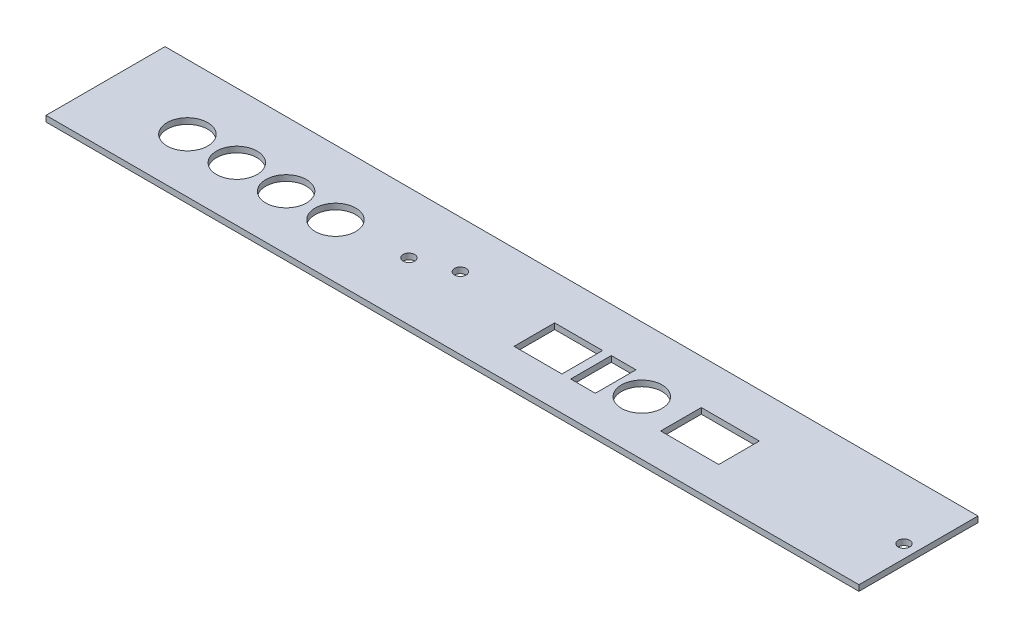
ISO-10303-21;
HEADER;
FILE_DESCRIPTION(('STEP AP214'),'2;1');
FILE_NAME('part.step','',(''),(''),'','','');
FILE_SCHEMA(('AUTOMOTIVE_DESIGN { 1 0 10303 214 1 1 1 1 }'));
ENDSEC;
DATA;
#1=APPLICATION_CONTEXT('core data for automotive mechanical design processes');
#2=APPLICATION_PROTOCOL_DEFINITION('international standard','automotive_design',2000,#1);
#3=PRODUCT_CONTEXT('',#1,'mechanical');
#4=PRODUCT('Part','Part','',(#3));
#5=PRODUCT_RELATED_PRODUCT_CATEGORY('part','',(#4));
#6=PRODUCT_DEFINITION_FORMATION('','',#4);
#7=PRODUCT_DEFINITION_CONTEXT('part definition',#1,'design');
#8=PRODUCT_DEFINITION('design','',#6,#7);
#9=PRODUCT_DEFINITION_SHAPE('','',#8);
#10=(LENGTH_UNIT() NAMED_UNIT(*) SI_UNIT(.MILLI.,.METRE.));
#11=(NAMED_UNIT(*) PLANE_ANGLE_UNIT() SI_UNIT($,.RADIAN.));
#12=(NAMED_UNIT(*) SI_UNIT($,.STERADIAN.) SOLID_ANGLE_UNIT());
#13=UNCERTAINTY_MEASURE_WITH_UNIT(LENGTH_MEASURE(1.E-05),#10,'distance_accuracy_value','');
#14=(GEOMETRIC_REPRESENTATION_CONTEXT(3) GLOBAL_UNCERTAINTY_ASSIGNED_CONTEXT((#13)) GLOBAL_UNIT_ASSIGNED_CONTEXT((#10,
#11,#12)) REPRESENTATION_CONTEXT('',''));
#15=CARTESIAN_POINT('',(0.,0.,0.));
#16=DIRECTION('',(0.,0.,1.));
#17=DIRECTION('',(1.,0.,0.));
#18=AXIS2_PLACEMENT_3D('',#15,#16,#17);
#19=CARTESIAN_POINT('',(0.,2.,0.));
#20=DIRECTION('',(0.,-1.,0.));
#21=DIRECTION('',(0.,0.,-1.));
#22=AXIS2_PLACEMENT_3D('',#19,#20,#21);
#23=PLANE('',#22);
#24=CARTESIAN_POINT('',(275.5,2.,-20.));
#25=DIRECTION('',(0.,1.,0.));
#26=DIRECTION('',(0.,0.,1.));
#27=AXIS2_PLACEMENT_3D('',#24,#25,#26);
#28=CIRCLE('',#27,2.);
#29=CARTESIAN_POINT('',(275.5,2.,-18.));
#30=VERTEX_POINT('',#29);
#31=EDGE_CURVE('E184',#30,#30,#28,.T.);
#32=ORIENTED_EDGE('',*,*,#31,.F.);
#33=EDGE_LOOP('',(#32));
#34=FACE_BOUND('',#33,.T.);
#35=CARTESIAN_POINT('',(118.,2.,-24.7));
#36=DIRECTION('',(0.,1.,0.));
#37=DIRECTION('',(0.,0.,1.));
#38=AXIS2_PLACEMENT_3D('',#35,#36,#37);
#39=CIRCLE('',#38,2.);
#40=CARTESIAN_POINT('',(118.,2.,-22.7));
#41=VERTEX_POINT('',#40);
#42=EDGE_CURVE('E196',#41,#41,#39,.T.);
#43=ORIENTED_EDGE('',*,*,#42,.F.);
#44=EDGE_LOOP('',(#43));
#45=FACE_BOUND('',#44,.T.);
#46=DIRECTION('',(0.,0.,1.));
#47=VECTOR('',#46,1.);
#48=CARTESIAN_POINT('',(169.,2.,-11.7));
#49=LINE('',#48,#47);
#50=CARTESIAN_POINT('',(169.,2.,-25.7));
#51=VERTEX_POINT('',#50);
#52=CARTESIAN_POINT('',(169.,2.,-11.7));
#53=VERTEX_POINT('',#52);
#54=EDGE_CURVE('E208',#51,#53,#49,.T.);
#55=ORIENTED_EDGE('',*,*,#54,.F.);
#56=DIRECTION('',(-1.,0.,0.));
#57=VECTOR('',#56,1.);
#58=CARTESIAN_POINT('',(169.,2.,-25.7));
#59=LINE('',#58,#57);
#60=CARTESIAN_POINT('',(177.5,2.,-25.7));
#61=VERTEX_POINT('',#60);
#62=EDGE_CURVE('E216',#61,#51,#59,.T.);
#63=ORIENTED_EDGE('',*,*,#62,.F.);
#64=DIRECTION('',(0.,0.,-1.));
#65=VECTOR('',#64,1.);
#66=CARTESIAN_POINT('',(177.5,2.,-11.7));
#67=LINE('',#66,#65);
#68=CARTESIAN_POINT('',(177.5,2.,-11.7));
#69=VERTEX_POINT('',#68);
#70=EDGE_CURVE('E213',#69,#61,#67,.T.);
#71=ORIENTED_EDGE('',*,*,#70,.F.);
#72=DIRECTION('',(1.,0.,0.));
#73=VECTOR('',#72,1.);
#74=CARTESIAN_POINT('',(169.,2.,-11.7));
#75=LINE('',#74,#73);
#76=EDGE_CURVE('E210',#53,#69,#75,.T.);
#77=ORIENTED_EDGE('',*,*,#76,.F.);
#78=EDGE_LOOP('',(#55,#63,#71,#77));
#79=FACE_BOUND('',#78,.T.);
#80=CARTESIAN_POINT('',(64.,2.,-18.7));
#81=DIRECTION('',(0.,1.,0.));
#82=DIRECTION('',(0.,0.,1.));
#83=AXIS2_PLACEMENT_3D('',#80,#81,#82);
#84=CIRCLE('',#83,7.);
#85=CARTESIAN_POINT('',(64.,2.,-11.7));
#86=VERTEX_POINT('',#85);
#87=EDGE_CURVE('E245',#86,#86,#84,.T.);
#88=ORIENTED_EDGE('',*,*,#87,.F.);
#89=EDGE_LOOP('',(#88));
#90=FACE_BOUND('',#89,.T.);
#91=DIRECTION('',(0.,0.,1.));
#92=VECTOR('',#91,1.);
#93=CARTESIAN_POINT('',(149.5,2.,-11.7));
#94=LINE('',#93,#92);
#95=CARTESIAN_POINT('',(149.5,2.,-25.7));
#96=VERTEX_POINT('',#95);
#97=CARTESIAN_POINT('',(149.5,2.,-11.7));
#98=VERTEX_POINT('',#97);
#99=EDGE_CURVE('E257',#96,#98,#94,.T.);
#100=ORIENTED_EDGE('',*,*,#99,.F.);
#101=DIRECTION('',(-1.,0.,0.));
#102=VECTOR('',#101,1.);
#103=CARTESIAN_POINT('',(149.5,2.,-25.7));
#104=LINE('',#103,#102);
#105=CARTESIAN_POINT('',(166.,2.,-25.7));
#106=VERTEX_POINT('',#105);
#107=EDGE_CURVE('E265',#106,#96,#104,.T.);
#108=ORIENTED_EDGE('',*,*,#107,.F.);
#109=DIRECTION('',(0.,0.,-1.));
#110=VECTOR('',#109,1.);
#111=CARTESIAN_POINT('',(166.,2.,-11.7));
#112=LINE('',#111,#110);
#113=CARTESIAN_POINT('',(166.,2.,-11.7));
#114=VERTEX_POINT('',#113);
#115=EDGE_CURVE('E262',#114,#106,#112,.T.);
#116=ORIENTED_EDGE('',*,*,#115,.F.);
#117=DIRECTION('',(1.,0.,0.));
#118=VECTOR('',#117,1.);
#119=CARTESIAN_POINT('',(149.5,2.,-11.7));
#120=LINE('',#119,#118);
#121=EDGE_CURVE('E259',#98,#114,#120,.T.);
#122=ORIENTED_EDGE('',*,*,#121,.F.);
#123=EDGE_LOOP('',(#100,#108,#116,#122));
#124=FACE_BOUND('',#123,.T.);
#125=DIRECTION('',(0.,0.,1.));
#126=VECTOR('',#125,1.);
#127=CARTESIAN_POINT('',(0.,2.,0.));
#128=LINE('',#127,#126);
#129=CARTESIAN_POINT('',(0.,2.,-41.));
#130=VERTEX_POINT('',#129);
#131=CARTESIAN_POINT('',(0.,2.,0.));
#132=VERTEX_POINT('',#131);
#133=EDGE_CURVE('E294',#130,#132,#128,.T.);
#134=ORIENTED_EDGE('',*,*,#133,.T.);
#135=DIRECTION('',(1.,0.,0.));
#136=VECTOR('',#135,1.);
#137=CARTESIAN_POINT('',(0.,2.,0.));
#138=LINE('',#137,#136);
#139=CARTESIAN_POINT('',(280.,2.,0.));
#140=VERTEX_POINT('',#139);
#141=EDGE_CURVE('E297',#132,#140,#138,.T.);
#142=ORIENTED_EDGE('',*,*,#141,.T.);
#143=DIRECTION('',(0.,0.,-1.));
#144=VECTOR('',#143,1.);
#145=CARTESIAN_POINT('',(280.,2.,0.));
#146=LINE('',#145,#144);
#147=CARTESIAN_POINT('',(280.,2.,-41.));
#148=VERTEX_POINT('',#147);
#149=EDGE_CURVE('E300',#140,#148,#146,.T.);
#150=ORIENTED_EDGE('',*,*,#149,.T.);
#151=DIRECTION('',(-1.,0.,0.));
#152=VECTOR('',#151,1.);
#153=CARTESIAN_POINT('',(0.,2.,-41.));
#154=LINE('',#153,#152);
#155=EDGE_CURVE('E302',#148,#130,#154,.T.);
#156=ORIENTED_EDGE('',*,*,#155,.T.);
#157=EDGE_LOOP('',(#134,#142,#150,#156));
#158=FACE_BOUND('',#157,.T.);
#159=CARTESIAN_POINT('',(30.,2.,-18.7));
#160=DIRECTION('',(0.,1.,0.));
#161=DIRECTION('',(0.,0.,1.));
#162=AXIS2_PLACEMENT_3D('',#159,#160,#161);
#163=CIRCLE('',#162,7.);
#164=CARTESIAN_POINT('',(30.,2.,-11.7));
#165=VERTEX_POINT('',#164);
#166=EDGE_CURVE('E288',#165,#165,#163,.T.);
#167=ORIENTED_EDGE('',*,*,#166,.F.);
#168=EDGE_LOOP('',(#167));
#169=FACE_BOUND('',#168,.T.);
#170=CARTESIAN_POINT('',(47.,2.,-18.7));
#171=DIRECTION('',(0.,1.,0.));
#172=DIRECTION('',(0.,0.,1.));
#173=AXIS2_PLACEMENT_3D('',#170,#171,#172);
#174=CIRCLE('',#173,7.);
#175=CARTESIAN_POINT('',(47.,2.,-11.7));
#176=VERTEX_POINT('',#175);
#177=EDGE_CURVE('E251',#176,#176,#174,.T.);
#178=ORIENTED_EDGE('',*,*,#177,.F.);
#179=EDGE_LOOP('',(#178));
#180=FACE_BOUND('',#179,.T.);
#181=CARTESIAN_POINT('',(81.,2.,-18.7));
#182=DIRECTION('',(0.,1.,0.));
#183=DIRECTION('',(0.,0.,1.));
#184=AXIS2_PLACEMENT_3D('',#181,#182,#183);
#185=CIRCLE('',#184,7.);
#186=CARTESIAN_POINT('',(81.,2.,-11.7));
#187=VERTEX_POINT('',#186);
#188=EDGE_CURVE('E239',#187,#187,#185,.T.);
#189=ORIENTED_EDGE('',*,*,#188,.F.);
#190=EDGE_LOOP('',(#189));
#191=FACE_BOUND('',#190,.T.);
#192=CARTESIAN_POINT('',(186.5,2.,-18.7));
#193=DIRECTION('',(0.,1.,0.));
#194=DIRECTION('',(0.,0.,1.));
#195=AXIS2_PLACEMENT_3D('',#192,#193,#194);
#196=CIRCLE('',#195,7.00000000000001);
#197=CARTESIAN_POINT('',(186.5,2.,-11.7));
#198=VERTEX_POINT('',#197);
#199=EDGE_CURVE('E202',#198,#198,#196,.T.);
#200=ORIENTED_EDGE('',*,*,#199,.F.);
#201=EDGE_LOOP('',(#200));
#202=FACE_BOUND('',#201,.T.);
#203=CARTESIAN_POINT('',(105.,2.,-20.));
#204=DIRECTION('',(0.,1.,0.));
#205=DIRECTION('',(0.,0.,1.));
#206=AXIS2_PLACEMENT_3D('',#203,#204,#205);
#207=CIRCLE('',#206,2.);
#208=CARTESIAN_POINT('',(105.,2.,-18.));
#209=VERTEX_POINT('',#208);
#210=EDGE_CURVE('E190',#209,#209,#207,.T.);
#211=ORIENTED_EDGE('',*,*,#210,.F.);
#212=EDGE_LOOP('',(#211));
#213=FACE_BOUND('',#212,.T.);
#214=DIRECTION('',(0.,0.,1.));
#215=VECTOR('',#214,1.);
#216=CARTESIAN_POINT('',(200.,2.,-11.7));
#217=LINE('',#216,#215);
#218=CARTESIAN_POINT('',(200.,2.,-25.7));
#219=VERTEX_POINT('',#218);
#220=CARTESIAN_POINT('',(200.,2.,-11.7));
#221=VERTEX_POINT('',#220);
#222=EDGE_CURVE('E148',#219,#221,#217,.T.);
#223=ORIENTED_EDGE('',*,*,#222,.F.);
#224=DIRECTION('',(-1.,0.,0.));
#225=VECTOR('',#224,1.);
#226=CARTESIAN_POINT('',(200.,2.,-25.7));
#227=LINE('',#226,#225);
#228=CARTESIAN_POINT('',(220.,2.,-25.7));
#229=VERTEX_POINT('',#228);
#230=EDGE_CURVE('E170',#229,#219,#227,.T.);
#231=ORIENTED_EDGE('',*,*,#230,.F.);
#232=DIRECTION('',(0.,0.,-1.));
#233=VECTOR('',#232,1.);
#234=CARTESIAN_POINT('',(220.,2.,-11.7));
#235=LINE('',#234,#233);
#236=CARTESIAN_POINT('',(220.,2.,-11.7));
#237=VERTEX_POINT('',#236);
#238=EDGE_CURVE('E168',#237,#229,#235,.T.);
#239=ORIENTED_EDGE('',*,*,#238,.F.);
#240=DIRECTION('',(1.,0.,0.));
#241=VECTOR('',#240,1.);
#242=CARTESIAN_POINT('',(200.,2.,-11.7));
#243=LINE('',#242,#241);
#244=EDGE_CURVE('E156',#221,#237,#243,.T.);
#245=ORIENTED_EDGE('',*,*,#244,.F.);
#246=EDGE_LOOP('',(#223,#231,#239,#245));
#247=FACE_BOUND('',#246,.T.);
#248=ADVANCED_FACE('F35',(#34,#45,#79,#90,#124,#158,#169,#180,#191,#202,#213,#247),#23,.F.);
#249=CARTESIAN_POINT('',(0.,0.,0.));
#250=DIRECTION('',(0.,-1.,0.));
#251=DIRECTION('',(0.,0.,-1.));
#252=AXIS2_PLACEMENT_3D('',#249,#250,#251);
#253=PLANE('',#252);
#254=CARTESIAN_POINT('',(275.5,0.,-20.));
#255=DIRECTION('',(0.,1.,0.));
#256=DIRECTION('',(0.,0.,1.));
#257=AXIS2_PLACEMENT_3D('',#254,#255,#256);
#258=CIRCLE('',#257,2.);
#259=CARTESIAN_POINT('',(275.5,0.,-18.));
#260=VERTEX_POINT('',#259);
#261=EDGE_CURVE('E164',#260,#260,#258,.T.);
#262=ORIENTED_EDGE('',*,*,#261,.T.);
#263=EDGE_LOOP('',(#262));
#264=FACE_BOUND('',#263,.T.);
#265=CARTESIAN_POINT('',(118.,0.,-24.7));
#266=DIRECTION('',(0.,1.,0.));
#267=DIRECTION('',(0.,0.,1.));
#268=AXIS2_PLACEMENT_3D('',#265,#266,#267);
#269=CIRCLE('',#268,2.);
#270=CARTESIAN_POINT('',(118.,0.,-22.7));
#271=VERTEX_POINT('',#270);
#272=EDGE_CURVE('E193',#271,#271,#269,.T.);
#273=ORIENTED_EDGE('',*,*,#272,.T.);
#274=EDGE_LOOP('',(#273));
#275=FACE_BOUND('',#274,.T.);
#276=DIRECTION('',(-1.,0.,0.));
#277=VECTOR('',#276,1.);
#278=CARTESIAN_POINT('',(169.,0.,-25.7));
#279=LINE('',#278,#277);
#280=CARTESIAN_POINT('',(177.5,0.,-25.7));
#281=VERTEX_POINT('',#280);
#282=CARTESIAN_POINT('',(169.,0.,-25.7));
#283=VERTEX_POINT('',#282);
#284=EDGE_CURVE('E211',#281,#283,#279,.T.);
#285=ORIENTED_EDGE('',*,*,#284,.T.);
#286=DIRECTION('',(0.,0.,1.));
#287=VECTOR('',#286,1.);
#288=CARTESIAN_POINT('',(169.,0.,-11.7));
#289=LINE('',#288,#287);
#290=CARTESIAN_POINT('',(169.,0.,-11.7));
#291=VERTEX_POINT('',#290);
#292=EDGE_CURVE('E205',#283,#291,#289,.T.);
#293=ORIENTED_EDGE('',*,*,#292,.T.);
#294=DIRECTION('',(1.,0.,0.));
#295=VECTOR('',#294,1.);
#296=CARTESIAN_POINT('',(169.,0.,-11.7));
#297=LINE('',#296,#295);
#298=CARTESIAN_POINT('',(177.5,0.,-11.7));
#299=VERTEX_POINT('',#298);
#300=EDGE_CURVE('E221',#291,#299,#297,.T.);
#301=ORIENTED_EDGE('',*,*,#300,.T.);
#302=DIRECTION('',(0.,0.,-1.));
#303=VECTOR('',#302,1.);
#304=CARTESIAN_POINT('',(177.5,0.,-11.7));
#305=LINE('',#304,#303);
#306=EDGE_CURVE('E224',#299,#281,#305,.T.);
#307=ORIENTED_EDGE('',*,*,#306,.T.);
#308=EDGE_LOOP('',(#285,#293,#301,#307));
#309=FACE_BOUND('',#308,.T.);
#310=CARTESIAN_POINT('',(64.,0.,-18.7));
#311=DIRECTION('',(0.,1.,0.));
#312=DIRECTION('',(0.,0.,1.));
#313=AXIS2_PLACEMENT_3D('',#310,#311,#312);
#314=CIRCLE('',#313,7.);
#315=CARTESIAN_POINT('',(64.,0.,-11.7));
#316=VERTEX_POINT('',#315);
#317=EDGE_CURVE('E242',#316,#316,#314,.T.);
#318=ORIENTED_EDGE('',*,*,#317,.T.);
#319=EDGE_LOOP('',(#318));
#320=FACE_BOUND('',#319,.T.);
#321=DIRECTION('',(-1.,0.,0.));
#322=VECTOR('',#321,1.);
#323=CARTESIAN_POINT('',(149.5,0.,-25.7));
#324=LINE('',#323,#322);
#325=CARTESIAN_POINT('',(166.,0.,-25.7));
#326=VERTEX_POINT('',#325);
#327=CARTESIAN_POINT('',(149.5,0.,-25.7));
#328=VERTEX_POINT('',#327);
#329=EDGE_CURVE('E260',#326,#328,#324,.T.);
#330=ORIENTED_EDGE('',*,*,#329,.T.);
#331=DIRECTION('',(0.,0.,1.));
#332=VECTOR('',#331,1.);
#333=CARTESIAN_POINT('',(149.5,0.,-11.7));
#334=LINE('',#333,#332);
#335=CARTESIAN_POINT('',(149.5,0.,-11.7));
#336=VERTEX_POINT('',#335);
#337=EDGE_CURVE('E254',#328,#336,#334,.T.);
#338=ORIENTED_EDGE('',*,*,#337,.T.);
#339=DIRECTION('',(1.,0.,0.));
#340=VECTOR('',#339,1.);
#341=CARTESIAN_POINT('',(149.5,0.,-11.7));
#342=LINE('',#341,#340);
#343=CARTESIAN_POINT('',(166.,0.,-11.7));
#344=VERTEX_POINT('',#343);
#345=EDGE_CURVE('E270',#336,#344,#342,.T.);
#346=ORIENTED_EDGE('',*,*,#345,.T.);
#347=DIRECTION('',(0.,0.,-1.));
#348=VECTOR('',#347,1.);
#349=CARTESIAN_POINT('',(166.,0.,-11.7));
#350=LINE('',#349,#348);
#351=EDGE_CURVE('E273',#344,#326,#350,.T.);
#352=ORIENTED_EDGE('',*,*,#351,.T.);
#353=EDGE_LOOP('',(#330,#338,#346,#352));
#354=FACE_BOUND('',#353,.T.);
#355=DIRECTION('',(0.,0.,1.));
#356=VECTOR('',#355,1.);
#357=CARTESIAN_POINT('',(0.,0.,0.));
#358=LINE('',#357,#356);
#359=CARTESIAN_POINT('',(0.,0.,-41.));
#360=VERTEX_POINT('',#359);
#361=CARTESIAN_POINT('',(0.,0.,0.));
#362=VERTEX_POINT('',#361);
#363=EDGE_CURVE('E291',#360,#362,#358,.T.);
#364=ORIENTED_EDGE('',*,*,#363,.F.);
#365=DIRECTION('',(-1.,0.,0.));
#366=VECTOR('',#365,1.);
#367=CARTESIAN_POINT('',(0.,0.,-41.));
#368=LINE('',#367,#366);
#369=CARTESIAN_POINT('',(280.,0.,-41.));
#370=VERTEX_POINT('',#369);
#371=EDGE_CURVE('E298',#370,#360,#368,.T.);
#372=ORIENTED_EDGE('',*,*,#371,.F.);
#373=DIRECTION('',(0.,0.,-1.));
#374=VECTOR('',#373,1.);
#375=CARTESIAN_POINT('',(280.,0.,0.));
#376=LINE('',#375,#374);
#377=CARTESIAN_POINT('',(280.,0.,0.));
#378=VERTEX_POINT('',#377);
#379=EDGE_CURVE('E309',#378,#370,#376,.T.);
#380=ORIENTED_EDGE('',*,*,#379,.F.);
#381=DIRECTION('',(1.,0.,0.));
#382=VECTOR('',#381,1.);
#383=CARTESIAN_POINT('',(0.,0.,0.));
#384=LINE('',#383,#382);
#385=EDGE_CURVE('E307',#362,#378,#384,.T.);
#386=ORIENTED_EDGE('',*,*,#385,.F.);
#387=EDGE_LOOP('',(#364,#372,#380,#386));
#388=FACE_BOUND('',#387,.T.);
#389=CARTESIAN_POINT('',(30.,0.,-18.7));
#390=DIRECTION('',(0.,1.,0.));
#391=DIRECTION('',(0.,0.,1.));
#392=AXIS2_PLACEMENT_3D('',#389,#390,#391);
#393=CIRCLE('',#392,7.);
#394=CARTESIAN_POINT('',(30.,0.,-11.7));
#395=VERTEX_POINT('',#394);
#396=EDGE_CURVE('E287',#395,#395,#393,.T.);
#397=ORIENTED_EDGE('',*,*,#396,.T.);
#398=EDGE_LOOP('',(#397));
#399=FACE_BOUND('',#398,.T.);
#400=CARTESIAN_POINT('',(47.,0.,-18.7));
#401=DIRECTION('',(0.,1.,0.));
#402=DIRECTION('',(0.,0.,1.));
#403=AXIS2_PLACEMENT_3D('',#400,#401,#402);
#404=CIRCLE('',#403,7.);
#405=CARTESIAN_POINT('',(47.,0.,-11.7));
#406=VERTEX_POINT('',#405);
#407=EDGE_CURVE('E248',#406,#406,#404,.T.);
#408=ORIENTED_EDGE('',*,*,#407,.T.);
#409=EDGE_LOOP('',(#408));
#410=FACE_BOUND('',#409,.T.);
#411=CARTESIAN_POINT('',(81.,0.,-18.7));
#412=DIRECTION('',(0.,1.,0.));
#413=DIRECTION('',(0.,0.,1.));
#414=AXIS2_PLACEMENT_3D('',#411,#412,#413);
#415=CIRCLE('',#414,7.);
#416=CARTESIAN_POINT('',(81.,0.,-11.7));
#417=VERTEX_POINT('',#416);
#418=EDGE_CURVE('E238',#417,#417,#415,.T.);
#419=ORIENTED_EDGE('',*,*,#418,.T.);
#420=EDGE_LOOP('',(#419));
#421=FACE_BOUND('',#420,.T.);
#422=CARTESIAN_POINT('',(186.5,0.,-18.7));
#423=DIRECTION('',(0.,1.,0.));
#424=DIRECTION('',(0.,0.,1.));
#425=AXIS2_PLACEMENT_3D('',#422,#423,#424);
#426=CIRCLE('',#425,7.00000000000001);
#427=CARTESIAN_POINT('',(186.5,0.,-11.7));
#428=VERTEX_POINT('',#427);
#429=EDGE_CURVE('E199',#428,#428,#426,.T.);
#430=ORIENTED_EDGE('',*,*,#429,.T.);
#431=EDGE_LOOP('',(#430));
#432=FACE_BOUND('',#431,.T.);
#433=CARTESIAN_POINT('',(105.,0.,-20.));
#434=DIRECTION('',(0.,1.,0.));
#435=DIRECTION('',(0.,0.,1.));
#436=AXIS2_PLACEMENT_3D('',#433,#434,#435);
#437=CIRCLE('',#436,2.);
#438=CARTESIAN_POINT('',(105.,0.,-18.));
#439=VERTEX_POINT('',#438);
#440=EDGE_CURVE('E187',#439,#439,#437,.T.);
#441=ORIENTED_EDGE('',*,*,#440,.T.);
#442=EDGE_LOOP('',(#441));
#443=FACE_BOUND('',#442,.T.);
#444=DIRECTION('',(-1.,0.,0.));
#445=VECTOR('',#444,1.);
#446=CARTESIAN_POINT('',(200.,0.,-25.7));
#447=LINE('',#446,#445);
#448=CARTESIAN_POINT('',(220.,0.,-25.7));
#449=VERTEX_POINT('',#448);
#450=CARTESIAN_POINT('',(200.,0.,-25.7));
#451=VERTEX_POINT('',#450);
#452=EDGE_CURVE('E157',#449,#451,#447,.T.);
#453=ORIENTED_EDGE('',*,*,#452,.T.);
#454=DIRECTION('',(0.,0.,1.));
#455=VECTOR('',#454,1.);
#456=CARTESIAN_POINT('',(200.,0.,-11.7));
#457=LINE('',#456,#455);
#458=CARTESIAN_POINT('',(200.,0.,-11.7));
#459=VERTEX_POINT('',#458);
#460=EDGE_CURVE('E58',#451,#459,#457,.T.);
#461=ORIENTED_EDGE('',*,*,#460,.T.);
#462=DIRECTION('',(1.,0.,0.));
#463=VECTOR('',#462,1.);
#464=CARTESIAN_POINT('',(200.,0.,-11.7));
#465=LINE('',#464,#463);
#466=CARTESIAN_POINT('',(220.,0.,-11.7));
#467=VERTEX_POINT('',#466);
#468=EDGE_CURVE('E163',#459,#467,#465,.T.);
#469=ORIENTED_EDGE('',*,*,#468,.T.);
#470=DIRECTION('',(0.,0.,-1.));
#471=VECTOR('',#470,1.);
#472=CARTESIAN_POINT('',(220.,0.,-11.7));
#473=LINE('',#472,#471);
#474=EDGE_CURVE('E176',#467,#449,#473,.T.);
#475=ORIENTED_EDGE('',*,*,#474,.T.);
#476=EDGE_LOOP('',(#453,#461,#469,#475));
#477=FACE_BOUND('',#476,.T.);
#478=ADVANCED_FACE('F327',(#264,#275,#309,#320,#354,#388,#399,#410,#421,#432,#443,#477),#253,.T.);
#479=CARTESIAN_POINT('',(0.,2.,0.));
#480=DIRECTION('',(1.,0.,0.));
#481=DIRECTION('',(0.,0.,-1.));
#482=AXIS2_PLACEMENT_3D('',#479,#480,#481);
#483=PLANE('',#482);
#484=ORIENTED_EDGE('',*,*,#363,.T.);
#485=DIRECTION('',(0.,-1.,0.));
#486=VECTOR('',#485,1.);
#487=CARTESIAN_POINT('',(0.,2.,0.));
#488=LINE('',#487,#486);
#489=EDGE_CURVE('E11',#132,#362,#488,.T.);
#490=ORIENTED_EDGE('',*,*,#489,.F.);
#491=ORIENTED_EDGE('',*,*,#133,.F.);
#492=DIRECTION('',(0.,-1.,0.));
#493=VECTOR('',#492,1.);
#494=CARTESIAN_POINT('',(0.,2.,-41.));
#495=LINE('',#494,#493);
#496=EDGE_CURVE('E304',#130,#360,#495,.T.);
#497=ORIENTED_EDGE('',*,*,#496,.T.);
#498=EDGE_LOOP('',(#484,#490,#491,#497));
#499=FACE_BOUND('',#498,.T.);
#500=ADVANCED_FACE('F37',(#499),#483,.F.);
#501=CARTESIAN_POINT('',(0.,2.,0.));
#502=DIRECTION('',(0.,0.,-1.));
#503=DIRECTION('',(-1.,0.,0.));
#504=AXIS2_PLACEMENT_3D('',#501,#502,#503);
#505=PLANE('',#504);
#506=ORIENTED_EDGE('',*,*,#385,.T.);
#507=DIRECTION('',(0.,-1.,0.));
#508=VECTOR('',#507,1.);
#509=CARTESIAN_POINT('',(280.,2.,0.));
#510=LINE('',#509,#508);
#511=EDGE_CURVE('E43',#140,#378,#510,.T.);
#512=ORIENTED_EDGE('',*,*,#511,.F.);
#513=ORIENTED_EDGE('',*,*,#141,.F.);
#514=ORIENTED_EDGE('',*,*,#489,.T.);
#515=EDGE_LOOP('',(#506,#512,#513,#514));
#516=FACE_BOUND('',#515,.T.);
#517=ADVANCED_FACE('F338',(#516),#505,.F.);
#518=CARTESIAN_POINT('',(280.,2.,0.));
#519=DIRECTION('',(-1.,0.,0.));
#520=DIRECTION('',(0.,0.,1.));
#521=AXIS2_PLACEMENT_3D('',#518,#519,#520);
#522=PLANE('',#521);
#523=ORIENTED_EDGE('',*,*,#379,.T.);
#524=DIRECTION('',(0.,-1.,0.));
#525=VECTOR('',#524,1.);
#526=CARTESIAN_POINT('',(280.,2.,-41.));
#527=LINE('',#526,#525);
#528=EDGE_CURVE('E314',#148,#370,#527,.T.);
#529=ORIENTED_EDGE('',*,*,#528,.F.);
#530=ORIENTED_EDGE('',*,*,#149,.F.);
#531=ORIENTED_EDGE('',*,*,#511,.T.);
#532=EDGE_LOOP('',(#523,#529,#530,#531));
#533=FACE_BOUND('',#532,.T.);
#534=ADVANCED_FACE('F321',(#533),#522,.F.);
#535=CARTESIAN_POINT('',(0.,2.,-41.));
#536=DIRECTION('',(0.,0.,1.));
#537=DIRECTION('',(1.,0.,0.));
#538=AXIS2_PLACEMENT_3D('',#535,#536,#537);
#539=PLANE('',#538);
#540=ORIENTED_EDGE('',*,*,#371,.T.);
#541=ORIENTED_EDGE('',*,*,#496,.F.);
#542=ORIENTED_EDGE('',*,*,#155,.F.);
#543=ORIENTED_EDGE('',*,*,#528,.T.);
#544=EDGE_LOOP('',(#540,#541,#542,#543));
#545=FACE_BOUND('',#544,.T.);
#546=ADVANCED_FACE('F331',(#545),#539,.F.);
#547=CARTESIAN_POINT('',(30.,2.,-18.7));
#548=DIRECTION('',(0.,-1.,0.));
#549=DIRECTION('',(0.,0.,-1.));
#550=AXIS2_PLACEMENT_3D('',#547,#548,#549);
#551=CYLINDRICAL_SURFACE('',#550,7.);
#552=ORIENTED_EDGE('',*,*,#166,.T.);
#553=EDGE_LOOP('',(#552));
#554=FACE_BOUND('',#553,.T.);
#555=ORIENTED_EDGE('',*,*,#396,.F.);
#556=EDGE_LOOP('',(#555));
#557=FACE_BOUND('',#556,.T.);
#558=ADVANCED_FACE('F356',(#554,#557),#551,.F.);
#559=CARTESIAN_POINT('',(149.5,2.,-11.7));
#560=DIRECTION('',(1.,0.,0.));
#561=DIRECTION('',(0.,0.,-1.));
#562=AXIS2_PLACEMENT_3D('',#559,#560,#561);
#563=PLANE('',#562);
#564=ORIENTED_EDGE('',*,*,#337,.F.);
#565=DIRECTION('',(0.,-1.,0.));
#566=VECTOR('',#565,1.);
#567=CARTESIAN_POINT('',(149.5,2.,-25.7));
#568=LINE('',#567,#566);
#569=EDGE_CURVE('E267',#96,#328,#568,.T.);
#570=ORIENTED_EDGE('',*,*,#569,.F.);
#571=ORIENTED_EDGE('',*,*,#99,.T.);
#572=DIRECTION('',(0.,-1.,0.));
#573=VECTOR('',#572,1.);
#574=CARTESIAN_POINT('',(149.5,2.,-11.7));
#575=LINE('',#574,#573);
#576=EDGE_CURVE('E284',#98,#336,#575,.T.);
#577=ORIENTED_EDGE('',*,*,#576,.T.);
#578=EDGE_LOOP('',(#564,#570,#571,#577));
#579=FACE_BOUND('',#578,.T.);
#580=ADVANCED_FACE('F363',(#579),#563,.T.);
#581=CARTESIAN_POINT('',(149.5,2.,-11.7));
#582=DIRECTION('',(0.,0.,-1.));
#583=DIRECTION('',(-1.,0.,0.));
#584=AXIS2_PLACEMENT_3D('',#581,#582,#583);
#585=PLANE('',#584);
#586=ORIENTED_EDGE('',*,*,#345,.F.);
#587=ORIENTED_EDGE('',*,*,#576,.F.);
#588=ORIENTED_EDGE('',*,*,#121,.T.);
#589=DIRECTION('',(0.,-1.,0.));
#590=VECTOR('',#589,1.);
#591=CARTESIAN_POINT('',(166.,2.,-11.7));
#592=LINE('',#591,#590);
#593=EDGE_CURVE('E282',#114,#344,#592,.T.);
#594=ORIENTED_EDGE('',*,*,#593,.T.);
#595=EDGE_LOOP('',(#586,#587,#588,#594));
#596=FACE_BOUND('',#595,.T.);
#597=ADVANCED_FACE('F368',(#596),#585,.T.);
#598=CARTESIAN_POINT('',(166.,2.,-11.7));
#599=DIRECTION('',(-1.,0.,0.));
#600=DIRECTION('',(0.,0.,1.));
#601=AXIS2_PLACEMENT_3D('',#598,#599,#600);
#602=PLANE('',#601);
#603=ORIENTED_EDGE('',*,*,#351,.F.);
#604=ORIENTED_EDGE('',*,*,#593,.F.);
#605=ORIENTED_EDGE('',*,*,#115,.T.);
#606=DIRECTION('',(0.,-1.,0.));
#607=VECTOR('',#606,1.);
#608=CARTESIAN_POINT('',(166.,2.,-25.7));
#609=LINE('',#608,#607);
#610=EDGE_CURVE('E280',#106,#326,#609,.T.);
#611=ORIENTED_EDGE('',*,*,#610,.T.);
#612=EDGE_LOOP('',(#603,#604,#605,#611));
#613=FACE_BOUND('',#612,.T.);
#614=ADVANCED_FACE('F444',(#613),#602,.T.);
#615=CARTESIAN_POINT('',(149.5,2.,-25.7));
#616=DIRECTION('',(0.,0.,1.));
#617=DIRECTION('',(1.,0.,0.));
#618=AXIS2_PLACEMENT_3D('',#615,#616,#617);
#619=PLANE('',#618);
#620=ORIENTED_EDGE('',*,*,#329,.F.);
#621=ORIENTED_EDGE('',*,*,#610,.F.);
#622=ORIENTED_EDGE('',*,*,#107,.T.);
#623=ORIENTED_EDGE('',*,*,#569,.T.);
#624=EDGE_LOOP('',(#620,#621,#622,#623));
#625=FACE_BOUND('',#624,.T.);
#626=ADVANCED_FACE('F440',(#625),#619,.T.);
#627=CARTESIAN_POINT('',(47.,2.,-18.7));
#628=DIRECTION('',(0.,-1.,0.));
#629=DIRECTION('',(0.,0.,-1.));
#630=AXIS2_PLACEMENT_3D('',#627,#628,#629);
#631=CYLINDRICAL_SURFACE('',#630,7.);
#632=ORIENTED_EDGE('',*,*,#177,.T.);
#633=EDGE_LOOP('',(#632));
#634=FACE_BOUND('',#633,.T.);
#635=ORIENTED_EDGE('',*,*,#407,.F.);
#636=EDGE_LOOP('',(#635));
#637=FACE_BOUND('',#636,.T.);
#638=ADVANCED_FACE('F436',(#634,#637),#631,.F.);
#639=CARTESIAN_POINT('',(64.,2.,-18.7));
#640=DIRECTION('',(0.,-1.,0.));
#641=DIRECTION('',(0.,0.,-1.));
#642=AXIS2_PLACEMENT_3D('',#639,#640,#641);
#643=CYLINDRICAL_SURFACE('',#642,7.);
#644=ORIENTED_EDGE('',*,*,#87,.T.);
#645=EDGE_LOOP('',(#644));
#646=FACE_BOUND('',#645,.T.);
#647=ORIENTED_EDGE('',*,*,#317,.F.);
#648=EDGE_LOOP('',(#647));
#649=FACE_BOUND('',#648,.T.);
#650=ADVANCED_FACE('F432',(#646,#649),#643,.F.);
#651=CARTESIAN_POINT('',(81.,2.,-18.7));
#652=DIRECTION('',(0.,-1.,0.));
#653=DIRECTION('',(0.,0.,-1.));
#654=AXIS2_PLACEMENT_3D('',#651,#652,#653);
#655=CYLINDRICAL_SURFACE('',#654,7.);
#656=ORIENTED_EDGE('',*,*,#188,.T.);
#657=EDGE_LOOP('',(#656));
#658=FACE_BOUND('',#657,.T.);
#659=ORIENTED_EDGE('',*,*,#418,.F.);
#660=EDGE_LOOP('',(#659));
#661=FACE_BOUND('',#660,.T.);
#662=ADVANCED_FACE('F428',(#658,#661),#655,.F.);
#663=CARTESIAN_POINT('',(169.,2.,-11.7));
#664=DIRECTION('',(1.,0.,0.));
#665=DIRECTION('',(0.,0.,-1.));
#666=AXIS2_PLACEMENT_3D('',#663,#664,#665);
#667=PLANE('',#666);
#668=ORIENTED_EDGE('',*,*,#292,.F.);
#669=DIRECTION('',(0.,-1.,0.));
#670=VECTOR('',#669,1.);
#671=CARTESIAN_POINT('',(169.,2.,-25.7));
#672=LINE('',#671,#670);
#673=EDGE_CURVE('E218',#51,#283,#672,.T.);
#674=ORIENTED_EDGE('',*,*,#673,.F.);
#675=ORIENTED_EDGE('',*,*,#54,.T.);
#676=DIRECTION('',(0.,-1.,0.));
#677=VECTOR('',#676,1.);
#678=CARTESIAN_POINT('',(169.,2.,-11.7));
#679=LINE('',#678,#677);
#680=EDGE_CURVE('E235',#53,#291,#679,.T.);
#681=ORIENTED_EDGE('',*,*,#680,.T.);
#682=EDGE_LOOP('',(#668,#674,#675,#681));
#683=FACE_BOUND('',#682,.T.);
#684=ADVANCED_FACE('F424',(#683),#667,.T.);
#685=CARTESIAN_POINT('',(169.,2.,-11.7));
#686=DIRECTION('',(0.,0.,-1.));
#687=DIRECTION('',(-1.,0.,0.));
#688=AXIS2_PLACEMENT_3D('',#685,#686,#687);
#689=PLANE('',#688);
#690=ORIENTED_EDGE('',*,*,#300,.F.);
#691=ORIENTED_EDGE('',*,*,#680,.F.);
#692=ORIENTED_EDGE('',*,*,#76,.T.);
#693=DIRECTION('',(0.,-1.,0.));
#694=VECTOR('',#693,1.);
#695=CARTESIAN_POINT('',(177.5,2.,-11.7));
#696=LINE('',#695,#694);
#697=EDGE_CURVE('E233',#69,#299,#696,.T.);
#698=ORIENTED_EDGE('',*,*,#697,.T.);
#699=EDGE_LOOP('',(#690,#691,#692,#698));
#700=FACE_BOUND('',#699,.T.);
#701=ADVANCED_FACE('F420',(#700),#689,.T.);
#702=CARTESIAN_POINT('',(177.5,2.,-11.7));
#703=DIRECTION('',(-1.,0.,0.));
#704=DIRECTION('',(0.,0.,1.));
#705=AXIS2_PLACEMENT_3D('',#702,#703,#704);
#706=PLANE('',#705);
#707=ORIENTED_EDGE('',*,*,#306,.F.);
#708=ORIENTED_EDGE('',*,*,#697,.F.);
#709=ORIENTED_EDGE('',*,*,#70,.T.);
#710=DIRECTION('',(0.,-1.,0.));
#711=VECTOR('',#710,1.);
#712=CARTESIAN_POINT('',(177.5,2.,-25.7));
#713=LINE('',#712,#711);
#714=EDGE_CURVE('E231',#61,#281,#713,.T.);
#715=ORIENTED_EDGE('',*,*,#714,.T.);
#716=EDGE_LOOP('',(#707,#708,#709,#715));
#717=FACE_BOUND('',#716,.T.);
#718=ADVANCED_FACE('F416',(#717),#706,.T.);
#719=CARTESIAN_POINT('',(169.,2.,-25.7));
#720=DIRECTION('',(0.,0.,1.));
#721=DIRECTION('',(1.,0.,0.));
#722=AXIS2_PLACEMENT_3D('',#719,#720,#721);
#723=PLANE('',#722);
#724=ORIENTED_EDGE('',*,*,#284,.F.);
#725=ORIENTED_EDGE('',*,*,#714,.F.);
#726=ORIENTED_EDGE('',*,*,#62,.T.);
#727=ORIENTED_EDGE('',*,*,#673,.T.);
#728=EDGE_LOOP('',(#724,#725,#726,#727));
#729=FACE_BOUND('',#728,.T.);
#730=ADVANCED_FACE('F412',(#729),#723,.T.);
#731=CARTESIAN_POINT('',(186.5,2.,-18.7));
#732=DIRECTION('',(0.,-1.,0.));
#733=DIRECTION('',(0.,0.,-1.));
#734=AXIS2_PLACEMENT_3D('',#731,#732,#733);
#735=CYLINDRICAL_SURFACE('',#734,7.00000000000001);
#736=ORIENTED_EDGE('',*,*,#199,.T.);
#737=EDGE_LOOP('',(#736));
#738=FACE_BOUND('',#737,.T.);
#739=ORIENTED_EDGE('',*,*,#429,.F.);
#740=EDGE_LOOP('',(#739));
#741=FACE_BOUND('',#740,.T.);
#742=ADVANCED_FACE('F408',(#738,#741),#735,.F.);
#743=CARTESIAN_POINT('',(118.,2.,-24.7));
#744=DIRECTION('',(0.,-1.,0.));
#745=DIRECTION('',(0.,0.,-1.));
#746=AXIS2_PLACEMENT_3D('',#743,#744,#745);
#747=CYLINDRICAL_SURFACE('',#746,2.);
#748=ORIENTED_EDGE('',*,*,#42,.T.);
#749=EDGE_LOOP('',(#748));
#750=FACE_BOUND('',#749,.T.);
#751=ORIENTED_EDGE('',*,*,#272,.F.);
#752=EDGE_LOOP('',(#751));
#753=FACE_BOUND('',#752,.T.);
#754=ADVANCED_FACE('F404',(#750,#753),#747,.F.);
#755=CARTESIAN_POINT('',(105.,2.,-20.));
#756=DIRECTION('',(0.,-1.,0.));
#757=DIRECTION('',(0.,0.,-1.));
#758=AXIS2_PLACEMENT_3D('',#755,#756,#757);
#759=CYLINDRICAL_SURFACE('',#758,2.);
#760=ORIENTED_EDGE('',*,*,#210,.T.);
#761=EDGE_LOOP('',(#760));
#762=FACE_BOUND('',#761,.T.);
#763=ORIENTED_EDGE('',*,*,#440,.F.);
#764=EDGE_LOOP('',(#763));
#765=FACE_BOUND('',#764,.T.);
#766=ADVANCED_FACE('F400',(#762,#765),#759,.F.);
#767=CARTESIAN_POINT('',(275.5,2.,-20.));
#768=DIRECTION('',(0.,-1.,0.));
#769=DIRECTION('',(0.,0.,-1.));
#770=AXIS2_PLACEMENT_3D('',#767,#768,#769);
#771=CYLINDRICAL_SURFACE('',#770,2.);
#772=ORIENTED_EDGE('',*,*,#31,.T.);
#773=EDGE_LOOP('',(#772));
#774=FACE_BOUND('',#773,.T.);
#775=ORIENTED_EDGE('',*,*,#261,.F.);
#776=EDGE_LOOP('',(#775));
#777=FACE_BOUND('',#776,.T.);
#778=ADVANCED_FACE('F397',(#774,#777),#771,.F.);
#779=CARTESIAN_POINT('',(200.,2.,-11.7));
#780=DIRECTION('',(1.,0.,0.));
#781=DIRECTION('',(0.,0.,-1.));
#782=AXIS2_PLACEMENT_3D('',#779,#780,#781);
#783=PLANE('',#782);
#784=ORIENTED_EDGE('',*,*,#460,.F.);
#785=DIRECTION('',(0.,-1.,0.));
#786=VECTOR('',#785,1.);
#787=CARTESIAN_POINT('',(200.,2.,-25.7));
#788=LINE('',#787,#786);
#789=EDGE_CURVE('E152',#219,#451,#788,.T.);
#790=ORIENTED_EDGE('',*,*,#789,.F.);
#791=ORIENTED_EDGE('',*,*,#222,.T.);
#792=DIRECTION('',(0.,-1.,0.));
#793=VECTOR('',#792,1.);
#794=CARTESIAN_POINT('',(200.,2.,-11.7));
#795=LINE('',#794,#793);
#796=EDGE_CURVE('E151',#221,#459,#795,.T.);
#797=ORIENTED_EDGE('',*,*,#796,.T.);
#798=EDGE_LOOP('',(#784,#790,#791,#797));
#799=FACE_BOUND('',#798,.T.);
#800=ADVANCED_FACE('F150',(#799),#783,.T.);
#801=CARTESIAN_POINT('',(200.,2.,-11.7));
#802=DIRECTION('',(0.,0.,-1.));
#803=DIRECTION('',(-1.,0.,0.));
#804=AXIS2_PLACEMENT_3D('',#801,#802,#803);
#805=PLANE('',#804);
#806=ORIENTED_EDGE('',*,*,#468,.F.);
#807=ORIENTED_EDGE('',*,*,#796,.F.);
#808=ORIENTED_EDGE('',*,*,#244,.T.);
#809=DIRECTION('',(0.,-1.,0.));
#810=VECTOR('',#809,1.);
#811=CARTESIAN_POINT('',(220.,2.,-11.7));
#812=LINE('',#811,#810);
#813=EDGE_CURVE('E165',#237,#467,#812,.T.);
#814=ORIENTED_EDGE('',*,*,#813,.T.);
#815=EDGE_LOOP('',(#806,#807,#808,#814));
#816=FACE_BOUND('',#815,.T.);
#817=ADVANCED_FACE('F160',(#816),#805,.T.);
#818=CARTESIAN_POINT('',(220.,2.,-11.7));
#819=DIRECTION('',(-1.,0.,0.));
#820=DIRECTION('',(0.,0.,1.));
#821=AXIS2_PLACEMENT_3D('',#818,#819,#820);
#822=PLANE('',#821);
#823=ORIENTED_EDGE('',*,*,#474,.F.);
#824=ORIENTED_EDGE('',*,*,#813,.F.);
#825=ORIENTED_EDGE('',*,*,#238,.T.);
#826=DIRECTION('',(0.,-1.,0.));
#827=VECTOR('',#826,1.);
#828=CARTESIAN_POINT('',(220.,2.,-25.7));
#829=LINE('',#828,#827);
#830=EDGE_CURVE('E50',#229,#449,#829,.T.);
#831=ORIENTED_EDGE('',*,*,#830,.T.);
#832=EDGE_LOOP('',(#823,#824,#825,#831));
#833=FACE_BOUND('',#832,.T.);
#834=ADVANCED_FACE('F385',(#833),#822,.T.);
#835=CARTESIAN_POINT('',(200.,2.,-25.7));
#836=DIRECTION('',(0.,0.,1.));
#837=DIRECTION('',(1.,0.,0.));
#838=AXIS2_PLACEMENT_3D('',#835,#836,#837);
#839=PLANE('',#838);
#840=ORIENTED_EDGE('',*,*,#452,.F.);
#841=ORIENTED_EDGE('',*,*,#830,.F.);
#842=ORIENTED_EDGE('',*,*,#230,.T.);
#843=ORIENTED_EDGE('',*,*,#789,.T.);
#844=EDGE_LOOP('',(#840,#841,#842,#843));
#845=FACE_BOUND('',#844,.T.);
#846=ADVANCED_FACE('F383',(#845),#839,.T.);
#847=CLOSED_SHELL('',(#248,#478,#500,#517,#534,#546,#558,#580,#597,#614,#626,#638,#650,#662,
#684,#701,#718,#730,#742,#754,#766,#778,#800,#817,#834,#846));
#848=MANIFOLD_SOLID_BREP('B2',#847);
#849=ADVANCED_BREP_SHAPE_REPRESENTATION('',(#18,#848),#14);
#850=SHAPE_DEFINITION_REPRESENTATION(#9,#849);
ENDSEC;
END-ISO-10303-21;
